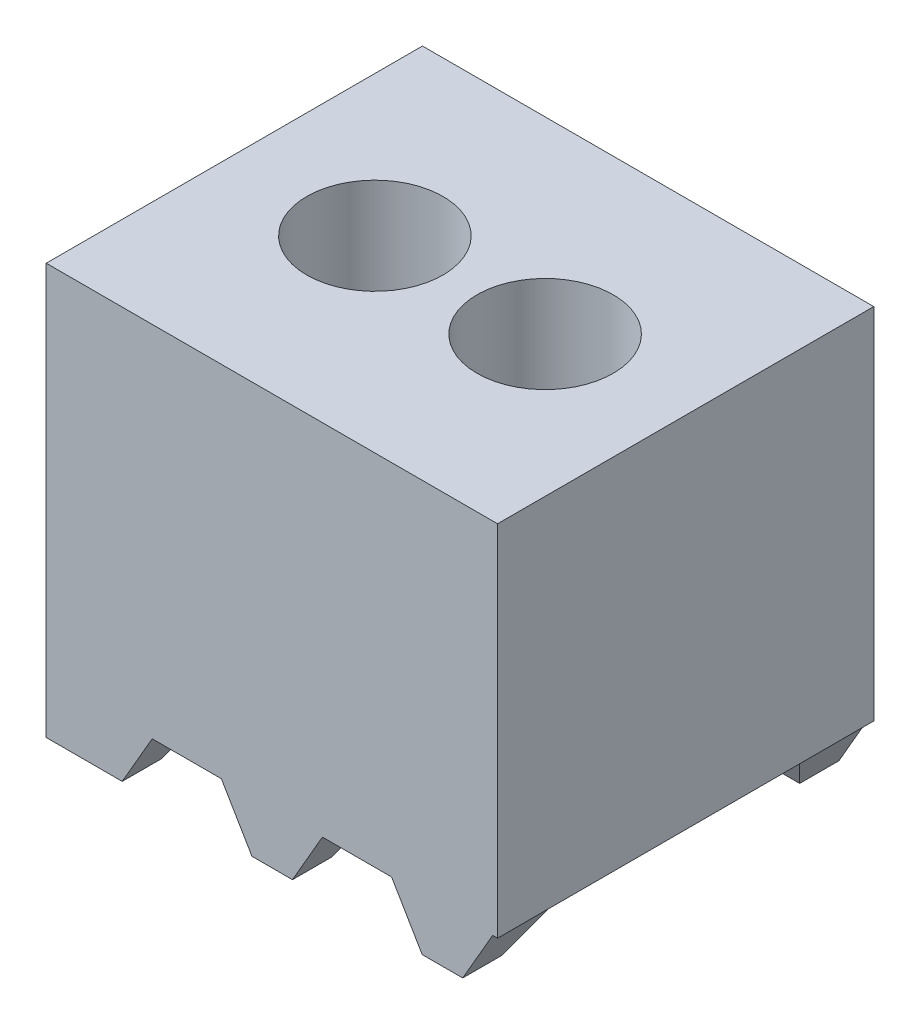
ISO-10303-21;
HEADER;
FILE_DESCRIPTION(('STEP AP214'),'2;1');
FILE_NAME('part.step','',(''),(''),'','','');
FILE_SCHEMA(('AUTOMOTIVE_DESIGN { 1 0 10303 214 1 1 1 1 }'));
ENDSEC;
DATA;
#1=APPLICATION_CONTEXT('core data for automotive mechanical design processes');
#2=APPLICATION_PROTOCOL_DEFINITION('international standard','automotive_design',2000,#1);
#3=PRODUCT_CONTEXT('',#1,'mechanical');
#4=PRODUCT('Part','Part','',(#3));
#5=PRODUCT_RELATED_PRODUCT_CATEGORY('part','',(#4));
#6=PRODUCT_DEFINITION_FORMATION('','',#4);
#7=PRODUCT_DEFINITION_CONTEXT('part definition',#1,'design');
#8=PRODUCT_DEFINITION('design','',#6,#7);
#9=PRODUCT_DEFINITION_SHAPE('','',#8);
#10=(LENGTH_UNIT() NAMED_UNIT(*) SI_UNIT(.MILLI.,.METRE.));
#11=(NAMED_UNIT(*) PLANE_ANGLE_UNIT() SI_UNIT($,.RADIAN.));
#12=(NAMED_UNIT(*) SI_UNIT($,.STERADIAN.) SOLID_ANGLE_UNIT());
#13=UNCERTAINTY_MEASURE_WITH_UNIT(LENGTH_MEASURE(1.E-05),#10,'distance_accuracy_value','');
#14=(GEOMETRIC_REPRESENTATION_CONTEXT(3) GLOBAL_UNCERTAINTY_ASSIGNED_CONTEXT((#13)) GLOBAL_UNIT_ASSIGNED_CONTEXT((#10,
#11,#12)) REPRESENTATION_CONTEXT('',''));
#15=CARTESIAN_POINT('',(0.,0.,0.));
#16=DIRECTION('',(0.,0.,1.));
#17=DIRECTION('',(1.,0.,0.));
#18=AXIS2_PLACEMENT_3D('',#15,#16,#17);
#19=CARTESIAN_POINT('',(0.,-2.413,0.));
#20=DIRECTION('',(0.,1.,0.));
#21=DIRECTION('',(0.,0.,1.));
#22=AXIS2_PLACEMENT_3D('',#19,#20,#21);
#23=PLANE('',#22);
#24=DIRECTION('',(1.,0.,0.));
#25=VECTOR('',#24,1.);
#26=CARTESIAN_POINT('',(0.,-2.413,-0.230423637951));
#27=LINE('',#26,#25);
#28=CARTESIAN_POINT('',(2.20832172,-2.413,-0.230423637951));
#29=VERTEX_POINT('',#28);
#30=CARTESIAN_POINT('',(2.44631972,-2.413,-0.230423637950998));
#31=VERTEX_POINT('',#30);
#32=EDGE_CURVE('E379',#29,#31,#27,.T.);
#33=ORIENTED_EDGE('',*,*,#32,.T.);
#34=DIRECTION('',(0.,0.,1.));
#35=VECTOR('',#34,1.);
#36=CARTESIAN_POINT('',(2.44631972,-2.413,-2.2098));
#37=LINE('',#36,#35);
#38=CARTESIAN_POINT('',(2.44631972,-2.413,0.));
#39=VERTEX_POINT('',#38);
#40=EDGE_CURVE('E198',#31,#39,#37,.T.);
#41=ORIENTED_EDGE('',*,*,#40,.T.);
#42=DIRECTION('',(1.,0.,0.));
#43=VECTOR('',#42,1.);
#44=CARTESIAN_POINT('',(0.,-2.413,0.));
#45=LINE('',#44,#43);
#46=CARTESIAN_POINT('',(2.20832172,-2.413,0.));
#47=VERTEX_POINT('',#46);
#48=EDGE_CURVE('E348',#47,#39,#45,.T.);
#49=ORIENTED_EDGE('',*,*,#48,.F.);
#50=DIRECTION('',(0.,0.,1.));
#51=VECTOR('',#50,1.);
#52=CARTESIAN_POINT('',(2.20832172,-2.413,-2.2098));
#53=LINE('',#52,#51);
#54=EDGE_CURVE('E245',#29,#47,#53,.T.);
#55=ORIENTED_EDGE('',*,*,#54,.F.);
#56=EDGE_LOOP('',(#33,#41,#49,#55));
#57=FACE_BOUND('',#56,.T.);
#58=ADVANCED_FACE('F16',(#57),#23,.F.);
#59=DIRECTION('',(-1.,0.,0.));
#60=VECTOR('',#59,1.);
#61=CARTESIAN_POINT('',(2.650998,-2.413,-2.2098));
#62=LINE('',#61,#60);
#63=CARTESIAN_POINT('',(2.44631972,-2.413,-2.2098));
#64=VERTEX_POINT('',#63);
#65=CARTESIAN_POINT('',(2.20832172,-2.413,-2.2098));
#66=VERTEX_POINT('',#65);
#67=EDGE_CURVE('E355',#64,#66,#62,.T.);
#68=ORIENTED_EDGE('',*,*,#67,.F.);
#69=CARTESIAN_POINT('',(2.44631972,-2.413,-1.979376362049));
#70=VERTEX_POINT('',#69);
#71=EDGE_CURVE('E204',#64,#70,#37,.T.);
#72=ORIENTED_EDGE('',*,*,#71,.T.);
#73=DIRECTION('',(-1.,0.,0.));
#74=VECTOR('',#73,1.);
#75=CARTESIAN_POINT('',(0.,-2.413,-1.979376362049));
#76=LINE('',#75,#74);
#77=CARTESIAN_POINT('',(2.20832172,-2.413,-1.979376362049));
#78=VERTEX_POINT('',#77);
#79=EDGE_CURVE('E377',#70,#78,#76,.T.);
#80=ORIENTED_EDGE('',*,*,#79,.T.);
#81=EDGE_CURVE('E242',#66,#78,#53,.T.);
#82=ORIENTED_EDGE('',*,*,#81,.F.);
#83=EDGE_LOOP('',(#68,#72,#80,#82));
#84=FACE_BOUND('',#83,.T.);
#85=ADVANCED_FACE('F408',(#84),#23,.F.);
#86=CARTESIAN_POINT('',(-61.230002,-2.1082,-0.406400000000001));
#87=DIRECTION('',(0.,0.500000000000006,0.866025403784435));
#88=DIRECTION('',(0.,-0.866025403784435,0.500000000000006));
#89=AXIS2_PLACEMENT_3D('',#86,#87,#88);
#90=PLANE('',#89);
#91=DIRECTION('',(1.,0.,0.));
#92=VECTOR('',#91,1.);
#93=CARTESIAN_POINT('',(-61.230002,-2.1082,-0.406400000000001));
#94=LINE('',#93,#92);
#95=CARTESIAN_POINT('',(2.028698082049,-2.1082,-0.406400000000001));
#96=VERTEX_POINT('',#95);
#97=CARTESIAN_POINT('',(2.622296082049,-2.1082,-0.406400000000001));
#98=VERTEX_POINT('',#97);
#99=EDGE_CURVE('E333',#96,#98,#94,.T.);
#100=ORIENTED_EDGE('',*,*,#99,.T.);
#101=DIRECTION('',(-0.447213595499953,-0.774596669241482,0.447213595499965));
#102=VECTOR('',#101,1.);
#103=CARTESIAN_POINT('',(-10.1481635343605,-24.2272848916281,12.3640596164098));
#104=LINE('',#103,#102);
#105=EDGE_CURVE('E218',#98,#31,#104,.T.);
#106=ORIENTED_EDGE('',*,*,#105,.T.);
#107=ORIENTED_EDGE('',*,*,#32,.F.);
#108=DIRECTION('',(-0.454582630893607,0.771372785213077,-0.445352285188329));
#109=VECTOR('',#108,1.);
#110=CARTESIAN_POINT('',(-11.0434192952275,20.0736320909451,-13.2130867288264));
#111=LINE('',#110,#109);
#112=EDGE_CURVE('E260',#29,#96,#111,.T.);
#113=ORIENTED_EDGE('',*,*,#112,.T.);
#114=EDGE_LOOP('',(#100,#106,#107,#113));
#115=FACE_BOUND('',#114,.T.);
#116=ADVANCED_FACE('F415',(#115),#90,.F.);
#117=CARTESIAN_POINT('',(-61.230002,-2.1082,-1.80339999999999));
#118=DIRECTION('',(0.,0.500000000000009,-0.866025403784434));
#119=DIRECTION('',(0.,0.866025403784434,0.500000000000009));
#120=AXIS2_PLACEMENT_3D('',#117,#118,#119);
#121=PLANE('',#120);
#122=ORIENTED_EDGE('',*,*,#79,.F.);
#123=DIRECTION('',(0.447213595499952,0.774596669241481,0.447213595499967));
#124=VECTOR('',#123,1.);
#125=CARTESIAN_POINT('',(-10.1481635343605,-24.227284891628,-14.5738596164099));
#126=LINE('',#125,#124);
#127=CARTESIAN_POINT('',(2.622296082049,-2.1082,-1.80339999999999));
#128=VERTEX_POINT('',#127);
#129=EDGE_CURVE('E215',#70,#128,#126,.T.);
#130=ORIENTED_EDGE('',*,*,#129,.T.);
#131=DIRECTION('',(1.,0.,0.));
#132=VECTOR('',#131,1.);
#133=CARTESIAN_POINT('',(-61.230002,-2.1082,-1.80339999999999));
#134=LINE('',#133,#132);
#135=CARTESIAN_POINT('',(2.028698082049,-2.1082,-1.80339999999999));
#136=VERTEX_POINT('',#135);
#137=EDGE_CURVE('E195',#136,#128,#134,.T.);
#138=ORIENTED_EDGE('',*,*,#137,.F.);
#139=DIRECTION('',(0.454582630893606,-0.771372785213076,-0.445352285188331));
#140=VECTOR('',#139,1.);
#141=CARTESIAN_POINT('',(-11.0434192952275,20.073632090945,11.0032867288265));
#142=LINE('',#141,#140);
#143=EDGE_CURVE('E257',#136,#78,#142,.T.);
#144=ORIENTED_EDGE('',*,*,#143,.T.);
#145=EDGE_LOOP('',(#122,#130,#138,#144));
#146=FACE_BOUND('',#145,.T.);
#147=ADVANCED_FACE('F448',(#146),#121,.F.);
#148=CARTESIAN_POINT('',(1.20832372,-2.413,-0.230423637951));
#149=VERTEX_POINT('',#148);
#150=CARTESIAN_POINT('',(1.44632172,-2.413,-0.230423637950998));
#151=VERTEX_POINT('',#150);
#152=EDGE_CURVE('E383',#149,#151,#27,.T.);
#153=ORIENTED_EDGE('',*,*,#152,.T.);
#154=DIRECTION('',(0.,0.,1.));
#155=VECTOR('',#154,1.);
#156=CARTESIAN_POINT('',(1.44632172,-2.413,-2.2098));
#157=LINE('',#156,#155);
#158=CARTESIAN_POINT('',(1.44632172,-2.413,0.));
#159=VERTEX_POINT('',#158);
#160=EDGE_CURVE('E249',#151,#159,#157,.T.);
#161=ORIENTED_EDGE('',*,*,#160,.T.);
#162=CARTESIAN_POINT('',(1.20832372,-2.413,0.));
#163=VERTEX_POINT('',#162);
#164=EDGE_CURVE('E354',#163,#159,#45,.T.);
#165=ORIENTED_EDGE('',*,*,#164,.F.);
#166=DIRECTION('',(0.,0.,1.));
#167=VECTOR('',#166,1.);
#168=CARTESIAN_POINT('',(1.20832372,-2.413,-2.2098));
#169=LINE('',#168,#167);
#170=EDGE_CURVE('E289',#149,#163,#169,.T.);
#171=ORIENTED_EDGE('',*,*,#170,.F.);
#172=EDGE_LOOP('',(#153,#161,#165,#171));
#173=FACE_BOUND('',#172,.T.);
#174=ADVANCED_FACE('F417',(#173),#23,.F.);
#175=CARTESIAN_POINT('',(1.44632172,-2.413,-2.2098));
#176=VERTEX_POINT('',#175);
#177=CARTESIAN_POINT('',(1.20832372,-2.413,-2.2098));
#178=VERTEX_POINT('',#177);
#179=EDGE_CURVE('E358',#176,#178,#62,.T.);
#180=ORIENTED_EDGE('',*,*,#179,.F.);
#181=CARTESIAN_POINT('',(1.44632172,-2.413,-1.979376362049));
#182=VERTEX_POINT('',#181);
#183=EDGE_CURVE('E246',#176,#182,#157,.T.);
#184=ORIENTED_EDGE('',*,*,#183,.T.);
#185=CARTESIAN_POINT('',(1.20832372,-2.413,-1.979376362049));
#186=VERTEX_POINT('',#185);
#187=EDGE_CURVE('E380',#182,#186,#76,.T.);
#188=ORIENTED_EDGE('',*,*,#187,.T.);
#189=EDGE_CURVE('E286',#178,#186,#169,.T.);
#190=ORIENTED_EDGE('',*,*,#189,.F.);
#191=EDGE_LOOP('',(#180,#184,#188,#190));
#192=FACE_BOUND('',#191,.T.);
#193=ADVANCED_FACE('F438',(#192),#23,.F.);
#194=CARTESIAN_POINT('',(1.028700082049,-2.1082,-0.406400000000001));
#195=VERTEX_POINT('',#194);
#196=CARTESIAN_POINT('',(1.622298082049,-2.1082,-0.406400000000001));
#197=VERTEX_POINT('',#196);
#198=EDGE_CURVE('E332',#195,#197,#94,.T.);
#199=ORIENTED_EDGE('',*,*,#198,.T.);
#200=DIRECTION('',(-0.447213595499953,-0.774596669241482,0.447213595499965));
#201=VECTOR('',#200,1.);
#202=CARTESIAN_POINT('',(-10.9481619343605,-23.8808754229346,12.1640600164098));
#203=LINE('',#202,#201);
#204=EDGE_CURVE('E254',#197,#151,#203,.T.);
#205=ORIENTED_EDGE('',*,*,#204,.T.);
#206=ORIENTED_EDGE('',*,*,#152,.F.);
#207=DIRECTION('',(-0.454582630893607,0.771372785213077,-0.445352285188329));
#208=VECTOR('',#207,1.);
#209=CARTESIAN_POINT('',(-11.8367723402081,19.7229801221486,-13.0106377202499));
#210=LINE('',#209,#208);
#211=EDGE_CURVE('E304',#149,#195,#210,.T.);
#212=ORIENTED_EDGE('',*,*,#211,.T.);
#213=EDGE_LOOP('',(#199,#205,#206,#212));
#214=FACE_BOUND('',#213,.T.);
#215=ADVANCED_FACE('F444',(#214),#90,.F.);
#216=ORIENTED_EDGE('',*,*,#187,.F.);
#217=DIRECTION('',(0.447213595499952,0.774596669241481,0.447213595499967));
#218=VECTOR('',#217,1.);
#219=CARTESIAN_POINT('',(-10.9481619343605,-23.8808754229345,-14.3738600164099));
#220=LINE('',#219,#218);
#221=CARTESIAN_POINT('',(1.622298082049,-2.1082,-1.80339999999999));
#222=VERTEX_POINT('',#221);
#223=EDGE_CURVE('E240',#182,#222,#220,.T.);
#224=ORIENTED_EDGE('',*,*,#223,.T.);
#225=CARTESIAN_POINT('',(1.028700082049,-2.1082,-1.8034));
#226=VERTEX_POINT('',#225);
#227=EDGE_CURVE('E337',#226,#222,#134,.T.);
#228=ORIENTED_EDGE('',*,*,#227,.F.);
#229=DIRECTION('',(0.454582630893606,-0.771372785213076,-0.445352285188331));
#230=VECTOR('',#229,1.);
#231=CARTESIAN_POINT('',(-11.8367723402081,19.7229801221485,10.8008377202499));
#232=LINE('',#231,#230);
#233=EDGE_CURVE('E301',#226,#186,#232,.T.);
#234=ORIENTED_EDGE('',*,*,#233,.T.);
#235=EDGE_LOOP('',(#216,#224,#228,#234));
#236=FACE_BOUND('',#235,.T.);
#237=ADVANCED_FACE('F436',(#236),#121,.F.);
#238=CARTESIAN_POINT('',(0.,-2.413,-0.230423637951));
#239=VERTEX_POINT('',#238);
#240=CARTESIAN_POINT('',(0.446323719999994,-2.413,-0.230423637951001));
#241=VERTEX_POINT('',#240);
#242=EDGE_CURVE('E24',#239,#241,#27,.T.);
#243=ORIENTED_EDGE('',*,*,#242,.T.);
#244=DIRECTION('',(0.,0.,1.));
#245=VECTOR('',#244,1.);
#246=CARTESIAN_POINT('',(0.44632372,-2.413,-2.2098));
#247=LINE('',#246,#245);
#248=CARTESIAN_POINT('',(0.44632372,-2.413,0.));
#249=VERTEX_POINT('',#248);
#250=EDGE_CURVE('E293',#241,#249,#247,.T.);
#251=ORIENTED_EDGE('',*,*,#250,.T.);
#252=CARTESIAN_POINT('',(0.,-2.413,0.));
#253=VERTEX_POINT('',#252);
#254=EDGE_CURVE('E350',#253,#249,#45,.T.);
#255=ORIENTED_EDGE('',*,*,#254,.F.);
#256=DIRECTION('',(0.,0.,1.));
#257=VECTOR('',#256,1.);
#258=CARTESIAN_POINT('',(0.,-2.413,-2.2098));
#259=LINE('',#258,#257);
#260=EDGE_CURVE('E349',#239,#253,#259,.T.);
#261=ORIENTED_EDGE('',*,*,#260,.F.);
#262=EDGE_LOOP('',(#243,#251,#255,#261));
#263=FACE_BOUND('',#262,.T.);
#264=ADVANCED_FACE('F425',(#263),#23,.F.);
#265=CARTESIAN_POINT('',(0.,-2.413,-2.2098));
#266=DIRECTION('',(-1.,0.,0.));
#267=DIRECTION('',(0.,0.,1.));
#268=AXIS2_PLACEMENT_3D('',#265,#266,#267);
#269=PLANE('',#268);
#270=DIRECTION('',(0.,0.866025403784435,-0.500000000000006));
#271=VECTOR('',#270,1.);
#272=CARTESIAN_POINT('',(0.,-1.55590489340756,-0.725267728463262));
#273=LINE('',#272,#271);
#274=CARTESIAN_POINT('',(0.,-2.1082,-0.406400000000001));
#275=VERTEX_POINT('',#274);
#276=EDGE_CURVE('E340',#239,#275,#273,.T.);
#277=ORIENTED_EDGE('',*,*,#276,.F.);
#278=ORIENTED_EDGE('',*,*,#260,.T.);
#279=DIRECTION('',(0.,1.,0.));
#280=VECTOR('',#279,1.);
#281=CARTESIAN_POINT('',(0.,-2.413,0.));
#282=LINE('',#281,#280);
#283=CARTESIAN_POINT('',(0.,0.,0.));
#284=VERTEX_POINT('',#283);
#285=EDGE_CURVE('E357',#253,#284,#282,.T.);
#286=ORIENTED_EDGE('',*,*,#285,.T.);
#287=DIRECTION('',(0.,0.,1.));
#288=VECTOR('',#287,1.);
#289=CARTESIAN_POINT('',(0.,0.,-2.2098));
#290=LINE('',#289,#288);
#291=CARTESIAN_POINT('',(0.,0.,-2.2098));
#292=VERTEX_POINT('',#291);
#293=EDGE_CURVE('E344',#292,#284,#290,.T.);
#294=ORIENTED_EDGE('',*,*,#293,.F.);
#295=DIRECTION('',(0.,1.,0.));
#296=VECTOR('',#295,1.);
#297=CARTESIAN_POINT('',(0.,-2.413,-2.2098));
#298=LINE('',#297,#296);
#299=CARTESIAN_POINT('',(0.,-2.413,-2.2098));
#300=VERTEX_POINT('',#299);
#301=EDGE_CURVE('E370',#300,#292,#298,.T.);
#302=ORIENTED_EDGE('',*,*,#301,.F.);
#303=CARTESIAN_POINT('',(0.,-2.413,-1.979376362049));
#304=VERTEX_POINT('',#303);
#305=EDGE_CURVE('E345',#300,#304,#259,.T.);
#306=ORIENTED_EDGE('',*,*,#305,.T.);
#307=DIRECTION('',(0.,-0.866025403784434,-0.500000000000009));
#308=VECTOR('',#307,1.);
#309=CARTESIAN_POINT('',(0.,-2.512776362049,-2.03698227153675));
#310=LINE('',#309,#308);
#311=CARTESIAN_POINT('',(0.,-2.1082,-1.80339999999999));
#312=VERTEX_POINT('',#311);
#313=EDGE_CURVE('E331',#312,#304,#310,.T.);
#314=ORIENTED_EDGE('',*,*,#313,.F.);
#315=DIRECTION('',(0.,0.,-1.));
#316=VECTOR('',#315,1.);
#317=CARTESIAN_POINT('',(0.,-2.1082,-2.2098));
#318=LINE('',#317,#316);
#319=EDGE_CURVE('E342',#275,#312,#318,.T.);
#320=ORIENTED_EDGE('',*,*,#319,.F.);
#321=EDGE_LOOP('',(#277,#278,#286,#294,#302,#306,#314,#320));
#322=FACE_BOUND('',#321,.T.);
#323=ADVANCED_FACE('F18',(#322),#269,.T.);
#324=CARTESIAN_POINT('',(2.650998,-2.413,-2.2098));
#325=DIRECTION('',(0.,0.,-1.));
#326=DIRECTION('',(-1.,0.,0.));
#327=AXIS2_PLACEMENT_3D('',#324,#325,#326);
#328=PLANE('',#327);
#329=DIRECTION('',(-1.,0.,0.));
#330=VECTOR('',#329,1.);
#331=CARTESIAN_POINT('',(2.622296082049,-2.1082,-2.2098));
#332=LINE('',#331,#330);
#333=CARTESIAN_POINT('',(2.650998,-2.1082,-2.2098));
#334=VERTEX_POINT('',#333);
#335=CARTESIAN_POINT('',(2.622296082049,-2.1082,-2.2098));
#336=VERTEX_POINT('',#335);
#337=EDGE_CURVE('E191',#334,#336,#332,.T.);
#338=ORIENTED_EDGE('',*,*,#337,.T.);
#339=DIRECTION('',(-0.499999999999996,-0.866025403784441,0.));
#340=VECTOR('',#339,1.);
#341=CARTESIAN_POINT('',(2.44631972,-2.413,-2.2098));
#342=LINE('',#341,#340);
#343=EDGE_CURVE('E201',#336,#64,#342,.T.);
#344=ORIENTED_EDGE('',*,*,#343,.T.);
#345=ORIENTED_EDGE('',*,*,#67,.T.);
#346=DIRECTION('',(-0.507711928450994,0.861526899004653,0.));
#347=VECTOR('',#346,1.);
#348=CARTESIAN_POINT('',(2.20832172,-2.413,-2.2098));
#349=LINE('',#348,#347);
#350=CARTESIAN_POINT('',(2.028698082049,-2.1082,-2.2098));
#351=VERTEX_POINT('',#350);
#352=EDGE_CURVE('E229',#66,#351,#349,.T.);
#353=ORIENTED_EDGE('',*,*,#352,.T.);
#354=DIRECTION('',(-1.,0.,0.));
#355=VECTOR('',#354,1.);
#356=CARTESIAN_POINT('',(1.622298082049,-2.1082,-2.2098));
#357=LINE('',#356,#355);
#358=CARTESIAN_POINT('',(1.622298082049,-2.1082,-2.2098));
#359=VERTEX_POINT('',#358);
#360=EDGE_CURVE('E222',#351,#359,#357,.T.);
#361=ORIENTED_EDGE('',*,*,#360,.T.);
#362=DIRECTION('',(-0.499999999999996,-0.866025403784441,0.));
#363=VECTOR('',#362,1.);
#364=CARTESIAN_POINT('',(1.44632172,-2.413,-2.2098));
#365=LINE('',#364,#363);
#366=EDGE_CURVE('E225',#359,#176,#365,.T.);
#367=ORIENTED_EDGE('',*,*,#366,.T.);
#368=ORIENTED_EDGE('',*,*,#179,.T.);
#369=DIRECTION('',(-0.507711928450994,0.861526899004653,0.));
#370=VECTOR('',#369,1.);
#371=CARTESIAN_POINT('',(1.20832372,-2.413,-2.2098));
#372=LINE('',#371,#370);
#373=CARTESIAN_POINT('',(1.028700082049,-2.1082,-2.2098));
#374=VERTEX_POINT('',#373);
#375=EDGE_CURVE('E271',#178,#374,#372,.T.);
#376=ORIENTED_EDGE('',*,*,#375,.T.);
#377=DIRECTION('',(-1.,0.,0.));
#378=VECTOR('',#377,1.);
#379=CARTESIAN_POINT('',(0.622300082048996,-2.1082,-2.2098));
#380=LINE('',#379,#378);
#381=CARTESIAN_POINT('',(0.622300082048996,-2.1082,-2.2098));
#382=VERTEX_POINT('',#381);
#383=EDGE_CURVE('E264',#374,#382,#380,.T.);
#384=ORIENTED_EDGE('',*,*,#383,.T.);
#385=DIRECTION('',(-0.499999999999996,-0.866025403784441,0.));
#386=VECTOR('',#385,1.);
#387=CARTESIAN_POINT('',(0.44632372,-2.413,-2.2098));
#388=LINE('',#387,#386);
#389=CARTESIAN_POINT('',(0.44632372,-2.413,-2.2098));
#390=VERTEX_POINT('',#389);
#391=EDGE_CURVE('E267',#382,#390,#388,.T.);
#392=ORIENTED_EDGE('',*,*,#391,.T.);
#393=EDGE_CURVE('E353',#390,#300,#62,.T.);
#394=ORIENTED_EDGE('',*,*,#393,.T.);
#395=ORIENTED_EDGE('',*,*,#301,.T.);
#396=DIRECTION('',(-1.,0.,0.));
#397=VECTOR('',#396,1.);
#398=CARTESIAN_POINT('',(2.650998,0.,-2.2098));
#399=LINE('',#398,#397);
#400=CARTESIAN_POINT('',(2.650998,0.,-2.2098));
#401=VERTEX_POINT('',#400);
#402=EDGE_CURVE('E367',#401,#292,#399,.T.);
#403=ORIENTED_EDGE('',*,*,#402,.F.);
#404=DIRECTION('',(0.,1.,0.));
#405=VECTOR('',#404,1.);
#406=CARTESIAN_POINT('',(2.650998,-2.413,-2.2098));
#407=LINE('',#406,#405);
#408=EDGE_CURVE('E210',#334,#401,#407,.T.);
#409=ORIENTED_EDGE('',*,*,#408,.F.);
#410=EDGE_LOOP('',(#338,#344,#345,#353,#361,#367,#368,#376,#384,#392,#394,#395,#403,#409));
#411=FACE_BOUND('',#410,.T.);
#412=ADVANCED_FACE('F208',(#411),#328,.T.);
#413=CARTESIAN_POINT('',(2.650998,-2.413,0.));
#414=DIRECTION('',(1.,0.,0.));
#415=DIRECTION('',(0.,0.,-1.));
#416=AXIS2_PLACEMENT_3D('',#413,#414,#415);
#417=PLANE('',#416);
#418=DIRECTION('',(0.,0.,1.));
#419=VECTOR('',#418,1.);
#420=CARTESIAN_POINT('',(2.650998,-2.1082,-0.406400000000001));
#421=LINE('',#420,#419);
#422=CARTESIAN_POINT('',(2.650998,-2.1082,0.));
#423=VERTEX_POINT('',#422);
#424=EDGE_CURVE('E31',#334,#423,#421,.T.);
#425=ORIENTED_EDGE('',*,*,#424,.F.);
#426=ORIENTED_EDGE('',*,*,#408,.T.);
#427=DIRECTION('',(0.,0.,-1.));
#428=VECTOR('',#427,1.);
#429=CARTESIAN_POINT('',(2.650998,0.,0.));
#430=LINE('',#429,#428);
#431=CARTESIAN_POINT('',(2.650998,0.,0.));
#432=VERTEX_POINT('',#431);
#433=EDGE_CURVE('E364',#432,#401,#430,.T.);
#434=ORIENTED_EDGE('',*,*,#433,.F.);
#435=DIRECTION('',(0.,1.,0.));
#436=VECTOR('',#435,1.);
#437=CARTESIAN_POINT('',(2.650998,-2.413,0.));
#438=LINE('',#437,#436);
#439=EDGE_CURVE('E374',#423,#432,#438,.T.);
#440=ORIENTED_EDGE('',*,*,#439,.F.);
#441=EDGE_LOOP('',(#425,#426,#434,#440));
#442=FACE_BOUND('',#441,.T.);
#443=ADVANCED_FACE('F432',(#442),#417,.T.);
#444=CARTESIAN_POINT('',(0.,-2.413,0.));
#445=DIRECTION('',(0.,0.,1.));
#446=DIRECTION('',(1.,0.,0.));
#447=AXIS2_PLACEMENT_3D('',#444,#445,#446);
#448=PLANE('',#447);
#449=DIRECTION('',(-1.,0.,0.));
#450=VECTOR('',#449,1.);
#451=CARTESIAN_POINT('',(0.,-2.1082,0.));
#452=LINE('',#451,#450);
#453=CARTESIAN_POINT('',(2.622296082049,-2.1082,0.));
#454=VERTEX_POINT('',#453);
#455=EDGE_CURVE('E11',#423,#454,#452,.T.);
#456=ORIENTED_EDGE('',*,*,#455,.F.);
#457=ORIENTED_EDGE('',*,*,#439,.T.);
#458=DIRECTION('',(1.,0.,0.));
#459=VECTOR('',#458,1.);
#460=CARTESIAN_POINT('',(0.,0.,0.));
#461=LINE('',#460,#459);
#462=EDGE_CURVE('E361',#284,#432,#461,.T.);
#463=ORIENTED_EDGE('',*,*,#462,.F.);
#464=ORIENTED_EDGE('',*,*,#285,.F.);
#465=ORIENTED_EDGE('',*,*,#254,.T.);
#466=DIRECTION('',(-0.499999999999996,-0.866025403784441,0.));
#467=VECTOR('',#466,1.);
#468=CARTESIAN_POINT('',(0.44632372,-2.413,0.));
#469=LINE('',#468,#467);
#470=CARTESIAN_POINT('',(0.622300082048996,-2.1082,0.));
#471=VERTEX_POINT('',#470);
#472=EDGE_CURVE('E277',#471,#249,#469,.T.);
#473=ORIENTED_EDGE('',*,*,#472,.F.);
#474=DIRECTION('',(-1.,0.,0.));
#475=VECTOR('',#474,1.);
#476=CARTESIAN_POINT('',(0.622300082048996,-2.1082,0.));
#477=LINE('',#476,#475);
#478=CARTESIAN_POINT('',(1.028700082049,-2.1082,0.));
#479=VERTEX_POINT('',#478);
#480=EDGE_CURVE('E263',#479,#471,#477,.T.);
#481=ORIENTED_EDGE('',*,*,#480,.F.);
#482=DIRECTION('',(-0.507711928450994,0.861526899004653,0.));
#483=VECTOR('',#482,1.);
#484=CARTESIAN_POINT('',(1.20832372,-2.413,0.));
#485=LINE('',#484,#483);
#486=EDGE_CURVE('E268',#163,#479,#485,.T.);
#487=ORIENTED_EDGE('',*,*,#486,.F.);
#488=ORIENTED_EDGE('',*,*,#164,.T.);
#489=DIRECTION('',(-0.499999999999996,-0.866025403784441,0.));
#490=VECTOR('',#489,1.);
#491=CARTESIAN_POINT('',(1.44632172,-2.413,0.));
#492=LINE('',#491,#490);
#493=CARTESIAN_POINT('',(1.622298082049,-2.1082,0.));
#494=VERTEX_POINT('',#493);
#495=EDGE_CURVE('E234',#494,#159,#492,.T.);
#496=ORIENTED_EDGE('',*,*,#495,.F.);
#497=DIRECTION('',(-1.,0.,0.));
#498=VECTOR('',#497,1.);
#499=CARTESIAN_POINT('',(1.622298082049,-2.1082,0.));
#500=LINE('',#499,#498);
#501=CARTESIAN_POINT('',(2.028698082049,-2.1082,0.));
#502=VERTEX_POINT('',#501);
#503=EDGE_CURVE('E221',#502,#494,#500,.T.);
#504=ORIENTED_EDGE('',*,*,#503,.F.);
#505=DIRECTION('',(-0.507711928450994,0.861526899004653,0.));
#506=VECTOR('',#505,1.);
#507=CARTESIAN_POINT('',(2.20832172,-2.413,0.));
#508=LINE('',#507,#506);
#509=EDGE_CURVE('E226',#47,#502,#508,.T.);
#510=ORIENTED_EDGE('',*,*,#509,.F.);
#511=ORIENTED_EDGE('',*,*,#48,.T.);
#512=DIRECTION('',(-0.499999999999996,-0.866025403784441,0.));
#513=VECTOR('',#512,1.);
#514=CARTESIAN_POINT('',(2.44631972,-2.413,0.));
#515=LINE('',#514,#513);
#516=EDGE_CURVE('E211',#454,#39,#515,.T.);
#517=ORIENTED_EDGE('',*,*,#516,.F.);
#518=EDGE_LOOP('',(#456,#457,#463,#464,#465,#473,#481,#487,#488,#496,#504,#510,#511,#517));
#519=FACE_BOUND('',#518,.T.);
#520=ADVANCED_FACE('F423',(#519),#448,.T.);
#521=ORIENTED_EDGE('',*,*,#393,.F.);
#522=CARTESIAN_POINT('',(0.446323719999999,-2.413,-1.979376362049));
#523=VERTEX_POINT('',#522);
#524=EDGE_CURVE('E290',#390,#523,#247,.T.);
#525=ORIENTED_EDGE('',*,*,#524,.T.);
#526=EDGE_CURVE('E372',#523,#304,#76,.T.);
#527=ORIENTED_EDGE('',*,*,#526,.T.);
#528=ORIENTED_EDGE('',*,*,#305,.F.);
#529=EDGE_LOOP('',(#521,#525,#527,#528));
#530=FACE_BOUND('',#529,.T.);
#531=ADVANCED_FACE('F411',(#530),#23,.F.);
#532=CARTESIAN_POINT('',(0.,0.,0.));
#533=DIRECTION('',(0.,1.,0.));
#534=DIRECTION('',(0.,0.,1.));
#535=AXIS2_PLACEMENT_3D('',#532,#533,#534);
#536=PLANE('',#535);
#537=CARTESIAN_POINT('',(1.825498,0.,-1.1049));
#538=DIRECTION('',(0.,1.,0.));
#539=DIRECTION('',(0.,0.,1.));
#540=AXIS2_PLACEMENT_3D('',#537,#538,#539);
#541=CIRCLE('',#540,0.400049999999999);
#542=CARTESIAN_POINT('',(1.825498,0.,-0.704850000000001));
#543=VERTEX_POINT('',#542);
#544=EDGE_CURVE('E307',#543,#543,#541,.T.);
#545=ORIENTED_EDGE('',*,*,#544,.F.);
#546=EDGE_LOOP('',(#545));
#547=FACE_BOUND('',#546,.T.);
#548=CARTESIAN_POINT('',(0.825499999999998,0.,-1.1049));
#549=DIRECTION('',(0.,1.,0.));
#550=DIRECTION('',(0.,0.,1.));
#551=AXIS2_PLACEMENT_3D('',#548,#549,#550);
#552=CIRCLE('',#551,0.400049999999999);
#553=CARTESIAN_POINT('',(0.825499999999998,0.,-0.704850000000001));
#554=VERTEX_POINT('',#553);
#555=EDGE_CURVE('E317',#554,#554,#552,.T.);
#556=ORIENTED_EDGE('',*,*,#555,.F.);
#557=EDGE_LOOP('',(#556));
#558=FACE_BOUND('',#557,.T.);
#559=ORIENTED_EDGE('',*,*,#293,.T.);
#560=ORIENTED_EDGE('',*,*,#462,.T.);
#561=ORIENTED_EDGE('',*,*,#433,.T.);
#562=ORIENTED_EDGE('',*,*,#402,.T.);
#563=EDGE_LOOP('',(#559,#560,#561,#562));
#564=FACE_BOUND('',#563,.T.);
#565=ADVANCED_FACE('F422',(#547,#558,#564),#536,.T.);
#566=CARTESIAN_POINT('',(0.622300082048996,-2.1082,-0.406400000000001));
#567=VERTEX_POINT('',#566);
#568=EDGE_CURVE('E328',#275,#567,#94,.T.);
#569=ORIENTED_EDGE('',*,*,#568,.T.);
#570=DIRECTION('',(-0.447213595499953,-0.774596669241482,0.447213595499965));
#571=VECTOR('',#570,1.);
#572=CARTESIAN_POINT('',(-11.7481603343605,-23.5344659542412,11.9640604164098));
#573=LINE('',#572,#571);
#574=EDGE_CURVE('E298',#567,#241,#573,.T.);
#575=ORIENTED_EDGE('',*,*,#574,.T.);
#576=ORIENTED_EDGE('',*,*,#242,.F.);
#577=ORIENTED_EDGE('',*,*,#276,.T.);
#578=EDGE_LOOP('',(#569,#575,#576,#577));
#579=FACE_BOUND('',#578,.T.);
#580=ADVANCED_FACE('F430',(#579),#90,.F.);
#581=CARTESIAN_POINT('',(-61.230002,-2.1082,-0.406400000000001));
#582=DIRECTION('',(0.,1.,0.));
#583=DIRECTION('',(0.,0.,1.));
#584=AXIS2_PLACEMENT_3D('',#581,#582,#583);
#585=PLANE('',#584);
#586=CARTESIAN_POINT('',(1.825498,-2.1082,-1.1049));
#587=DIRECTION('',(0.,1.,0.));
#588=DIRECTION('',(0.,0.,1.));
#589=AXIS2_PLACEMENT_3D('',#586,#587,#588);
#590=CIRCLE('',#589,0.32512);
#591=CARTESIAN_POINT('',(1.825498,-2.1082,-0.77978));
#592=VERTEX_POINT('',#591);
#593=EDGE_CURVE('E316',#592,#592,#590,.T.);
#594=ORIENTED_EDGE('',*,*,#593,.T.);
#595=EDGE_LOOP('',(#594));
#596=FACE_BOUND('',#595,.T.);
#597=CARTESIAN_POINT('',(0.825499999999998,-2.1082,-1.1049));
#598=DIRECTION('',(0.,1.,0.));
#599=DIRECTION('',(0.,0.,1.));
#600=AXIS2_PLACEMENT_3D('',#597,#598,#599);
#601=CIRCLE('',#600,0.32512);
#602=CARTESIAN_POINT('',(0.825499999999998,-2.1082,-0.77978));
#603=VERTEX_POINT('',#602);
#604=EDGE_CURVE('E326',#603,#603,#601,.T.);
#605=ORIENTED_EDGE('',*,*,#604,.T.);
#606=EDGE_LOOP('',(#605));
#607=FACE_BOUND('',#606,.T.);
#608=ORIENTED_EDGE('',*,*,#137,.T.);
#609=DIRECTION('',(0.,0.,1.));
#610=VECTOR('',#609,1.);
#611=CARTESIAN_POINT('',(2.622296082049,-2.1082,-2.2098));
#612=LINE('',#611,#610);
#613=EDGE_CURVE('E187',#336,#128,#612,.T.);
#614=ORIENTED_EDGE('',*,*,#613,.F.);
#615=ORIENTED_EDGE('',*,*,#337,.F.);
#616=ORIENTED_EDGE('',*,*,#424,.T.);
#617=ORIENTED_EDGE('',*,*,#455,.T.);
#618=EDGE_CURVE('E39',#98,#454,#612,.T.);
#619=ORIENTED_EDGE('',*,*,#618,.F.);
#620=ORIENTED_EDGE('',*,*,#99,.F.);
#621=DIRECTION('',(0.,0.,1.));
#622=VECTOR('',#621,1.);
#623=CARTESIAN_POINT('',(2.028698082049,-2.1082,-2.2098));
#624=LINE('',#623,#622);
#625=EDGE_CURVE('E241',#96,#502,#624,.T.);
#626=ORIENTED_EDGE('',*,*,#625,.T.);
#627=ORIENTED_EDGE('',*,*,#503,.T.);
#628=DIRECTION('',(0.,0.,1.));
#629=VECTOR('',#628,1.);
#630=CARTESIAN_POINT('',(1.622298082049,-2.1082,-2.2098));
#631=LINE('',#630,#629);
#632=EDGE_CURVE('E232',#197,#494,#631,.T.);
#633=ORIENTED_EDGE('',*,*,#632,.F.);
#634=ORIENTED_EDGE('',*,*,#198,.F.);
#635=DIRECTION('',(0.,0.,1.));
#636=VECTOR('',#635,1.);
#637=CARTESIAN_POINT('',(1.028700082049,-2.1082,-2.2098));
#638=LINE('',#637,#636);
#639=EDGE_CURVE('E285',#195,#479,#638,.T.);
#640=ORIENTED_EDGE('',*,*,#639,.T.);
#641=ORIENTED_EDGE('',*,*,#480,.T.);
#642=DIRECTION('',(0.,0.,1.));
#643=VECTOR('',#642,1.);
#644=CARTESIAN_POINT('',(0.622300082048996,-2.1082,-2.2098));
#645=LINE('',#644,#643);
#646=EDGE_CURVE('E274',#567,#471,#645,.T.);
#647=ORIENTED_EDGE('',*,*,#646,.F.);
#648=ORIENTED_EDGE('',*,*,#568,.F.);
#649=ORIENTED_EDGE('',*,*,#319,.T.);
#650=CARTESIAN_POINT('',(0.622300082048998,-2.1082,-1.80339999999999));
#651=VERTEX_POINT('',#650);
#652=EDGE_CURVE('E334',#312,#651,#134,.T.);
#653=ORIENTED_EDGE('',*,*,#652,.T.);
#654=EDGE_CURVE('E294',#382,#651,#645,.T.);
#655=ORIENTED_EDGE('',*,*,#654,.F.);
#656=ORIENTED_EDGE('',*,*,#383,.F.);
#657=EDGE_CURVE('E281',#374,#226,#638,.T.);
#658=ORIENTED_EDGE('',*,*,#657,.T.);
#659=ORIENTED_EDGE('',*,*,#227,.T.);
#660=EDGE_CURVE('E250',#359,#222,#631,.T.);
#661=ORIENTED_EDGE('',*,*,#660,.F.);
#662=ORIENTED_EDGE('',*,*,#360,.F.);
#663=EDGE_CURVE('E238',#351,#136,#624,.T.);
#664=ORIENTED_EDGE('',*,*,#663,.T.);
#665=EDGE_LOOP('',(#608,#614,#615,#616,#617,#619,#620,#626,#627,#633,#634,#640,#641,#647,#648,
#649,#653,#655,#656,#658,#659,#661,#662,#664));
#666=FACE_BOUND('',#665,.T.);
#667=ADVANCED_FACE('F189',(#596,#607,#666),#585,.F.);
#668=ORIENTED_EDGE('',*,*,#526,.F.);
#669=DIRECTION('',(0.447213595499952,0.774596669241481,0.447213595499967));
#670=VECTOR('',#669,1.);
#671=CARTESIAN_POINT('',(-11.7481603343605,-23.5344659542411,-14.1738604164099));
#672=LINE('',#671,#670);
#673=EDGE_CURVE('E284',#523,#651,#672,.T.);
#674=ORIENTED_EDGE('',*,*,#673,.T.);
#675=ORIENTED_EDGE('',*,*,#652,.F.);
#676=ORIENTED_EDGE('',*,*,#313,.T.);
#677=EDGE_LOOP('',(#668,#674,#675,#676));
#678=FACE_BOUND('',#677,.T.);
#679=ADVANCED_FACE('F447',(#678),#121,.F.);
#680=CARTESIAN_POINT('',(0.825499999999998,0.,-1.1049));
#681=DIRECTION('',(0.,1.,0.));
#682=DIRECTION('',(0.,0.,1.));
#683=AXIS2_PLACEMENT_3D('',#680,#681,#682);
#684=CYLINDRICAL_SURFACE('',#683,0.32512);
#685=CARTESIAN_POINT('',(0.825499999999998,-0.680022486183735,-1.1049));
#686=DIRECTION('',(0.,1.,0.));
#687=DIRECTION('',(0.,0.,1.));
#688=AXIS2_PLACEMENT_3D('',#685,#686,#687);
#689=CIRCLE('',#688,0.32512);
#690=CARTESIAN_POINT('',(0.825499999999998,-0.680022486183735,-0.77978));
#691=VERTEX_POINT('',#690);
#692=EDGE_CURVE('E323',#691,#691,#689,.T.);
#693=ORIENTED_EDGE('',*,*,#692,.T.);
#694=EDGE_LOOP('',(#693));
#695=FACE_BOUND('',#694,.T.);
#696=ORIENTED_EDGE('',*,*,#604,.F.);
#697=EDGE_LOOP('',(#696));
#698=FACE_BOUND('',#697,.T.);
#699=ADVANCED_FACE('F749',(#695,#698),#684,.F.);
#700=CARTESIAN_POINT('',(0.825499999999998,-0.635,-1.1049));
#701=DIRECTION('',(0.,1.,0.));
#702=DIRECTION('',(0.,0.,1.));
#703=AXIS2_PLACEMENT_3D('',#700,#701,#702);
#704=CONICAL_SURFACE('',#703,0.40005,1.02974425867666);
#705=ORIENTED_EDGE('',*,*,#692,.F.);
#706=EDGE_LOOP('',(#705));
#707=FACE_BOUND('',#706,.T.);
#708=CARTESIAN_POINT('',(0.825499999999998,-0.635,-1.1049));
#709=DIRECTION('',(0.,1.,0.));
#710=DIRECTION('',(0.,0.,1.));
#711=AXIS2_PLACEMENT_3D('',#708,#709,#710);
#712=CIRCLE('',#711,0.40005);
#713=CARTESIAN_POINT('',(0.825499999999998,-0.635,-0.70485));
#714=VERTEX_POINT('',#713);
#715=EDGE_CURVE('E320',#714,#714,#712,.T.);
#716=ORIENTED_EDGE('',*,*,#715,.T.);
#717=EDGE_LOOP('',(#716));
#718=FACE_BOUND('',#717,.T.);
#719=ADVANCED_FACE('F404',(#707,#718),#704,.F.);
#720=CARTESIAN_POINT('',(0.825499999999998,0.,-1.1049));
#721=DIRECTION('',(0.,1.,0.));
#722=DIRECTION('',(0.,0.,1.));
#723=AXIS2_PLACEMENT_3D('',#720,#721,#722);
#724=CYLINDRICAL_SURFACE('',#723,0.400049999999999);
#725=ORIENTED_EDGE('',*,*,#715,.F.);
#726=EDGE_LOOP('',(#725));
#727=FACE_BOUND('',#726,.T.);
#728=ORIENTED_EDGE('',*,*,#555,.T.);
#729=EDGE_LOOP('',(#728));
#730=FACE_BOUND('',#729,.T.);
#731=ADVANCED_FACE('F393',(#727,#730),#724,.F.);
#732=CARTESIAN_POINT('',(1.825498,0.,-1.1049));
#733=DIRECTION('',(0.,1.,0.));
#734=DIRECTION('',(0.,0.,1.));
#735=AXIS2_PLACEMENT_3D('',#732,#733,#734);
#736=CYLINDRICAL_SURFACE('',#735,0.32512);
#737=CARTESIAN_POINT('',(1.825498,-0.680022486183735,-1.1049));
#738=DIRECTION('',(0.,1.,0.));
#739=DIRECTION('',(0.,0.,1.));
#740=AXIS2_PLACEMENT_3D('',#737,#738,#739);
#741=CIRCLE('',#740,0.32512);
#742=CARTESIAN_POINT('',(1.825498,-0.680022486183735,-0.779779999999999));
#743=VERTEX_POINT('',#742);
#744=EDGE_CURVE('E313',#743,#743,#741,.T.);
#745=ORIENTED_EDGE('',*,*,#744,.T.);
#746=EDGE_LOOP('',(#745));
#747=FACE_BOUND('',#746,.T.);
#748=ORIENTED_EDGE('',*,*,#593,.F.);
#749=EDGE_LOOP('',(#748));
#750=FACE_BOUND('',#749,.T.);
#751=ADVANCED_FACE('F390',(#747,#750),#736,.F.);
#752=CARTESIAN_POINT('',(1.825498,-0.635,-1.1049));
#753=DIRECTION('',(0.,1.,0.));
#754=DIRECTION('',(0.,0.,1.));
#755=AXIS2_PLACEMENT_3D('',#752,#753,#754);
#756=CONICAL_SURFACE('',#755,0.40005,1.02974425867666);
#757=ORIENTED_EDGE('',*,*,#744,.F.);
#758=EDGE_LOOP('',(#757));
#759=FACE_BOUND('',#758,.T.);
#760=CARTESIAN_POINT('',(1.825498,-0.635,-1.1049));
#761=DIRECTION('',(0.,1.,0.));
#762=DIRECTION('',(0.,0.,1.));
#763=AXIS2_PLACEMENT_3D('',#760,#761,#762);
#764=CIRCLE('',#763,0.40005);
#765=CARTESIAN_POINT('',(1.825498,-0.635,-0.70485));
#766=VERTEX_POINT('',#765);
#767=EDGE_CURVE('E310',#766,#766,#764,.T.);
#768=ORIENTED_EDGE('',*,*,#767,.T.);
#769=EDGE_LOOP('',(#768));
#770=FACE_BOUND('',#769,.T.);
#771=ADVANCED_FACE('F392',(#759,#770),#756,.F.);
#772=CARTESIAN_POINT('',(1.825498,0.,-1.1049));
#773=DIRECTION('',(0.,1.,0.));
#774=DIRECTION('',(0.,0.,1.));
#775=AXIS2_PLACEMENT_3D('',#772,#773,#774);
#776=CYLINDRICAL_SURFACE('',#775,0.400049999999999);
#777=ORIENTED_EDGE('',*,*,#767,.F.);
#778=EDGE_LOOP('',(#777));
#779=FACE_BOUND('',#778,.T.);
#780=ORIENTED_EDGE('',*,*,#544,.T.);
#781=EDGE_LOOP('',(#780));
#782=FACE_BOUND('',#781,.T.);
#783=ADVANCED_FACE('F401',(#779,#782),#776,.F.);
#784=CARTESIAN_POINT('',(1.20832372,-2.413,-2.2098));
#785=DIRECTION('',(0.861526899004653,0.507711928450994,0.));
#786=DIRECTION('',(-0.507711928450994,0.861526899004653,0.));
#787=AXIS2_PLACEMENT_3D('',#784,#785,#786);
#788=PLANE('',#787);
#789=ORIENTED_EDGE('',*,*,#657,.F.);
#790=ORIENTED_EDGE('',*,*,#375,.F.);
#791=ORIENTED_EDGE('',*,*,#189,.T.);
#792=ORIENTED_EDGE('',*,*,#233,.F.);
#793=EDGE_LOOP('',(#789,#790,#791,#792));
#794=FACE_BOUND('',#793,.T.);
#795=ADVANCED_FACE('F586',(#794),#788,.F.);
#796=CARTESIAN_POINT('',(0.44632372,-2.413,-2.2098));
#797=DIRECTION('',(-0.866025403784441,0.499999999999996,0.));
#798=DIRECTION('',(-0.499999999999996,-0.866025403784441,0.));
#799=AXIS2_PLACEMENT_3D('',#796,#797,#798);
#800=PLANE('',#799);
#801=ORIENTED_EDGE('',*,*,#524,.F.);
#802=ORIENTED_EDGE('',*,*,#391,.F.);
#803=ORIENTED_EDGE('',*,*,#654,.T.);
#804=ORIENTED_EDGE('',*,*,#673,.F.);
#805=EDGE_LOOP('',(#801,#802,#803,#804));
#806=FACE_BOUND('',#805,.T.);
#807=ADVANCED_FACE('F598',(#806),#800,.F.);
#808=ORIENTED_EDGE('',*,*,#170,.T.);
#809=ORIENTED_EDGE('',*,*,#486,.T.);
#810=ORIENTED_EDGE('',*,*,#639,.F.);
#811=ORIENTED_EDGE('',*,*,#211,.F.);
#812=EDGE_LOOP('',(#808,#809,#810,#811));
#813=FACE_BOUND('',#812,.T.);
#814=ADVANCED_FACE('F601',(#813),#788,.F.);
#815=ORIENTED_EDGE('',*,*,#646,.T.);
#816=ORIENTED_EDGE('',*,*,#472,.T.);
#817=ORIENTED_EDGE('',*,*,#250,.F.);
#818=ORIENTED_EDGE('',*,*,#574,.F.);
#819=EDGE_LOOP('',(#815,#816,#817,#818));
#820=FACE_BOUND('',#819,.T.);
#821=ADVANCED_FACE('F612',(#820),#800,.F.);
#822=CARTESIAN_POINT('',(1.44632172,-2.413,-2.2098));
#823=DIRECTION('',(-0.866025403784441,0.499999999999996,0.));
#824=DIRECTION('',(-0.499999999999996,-0.866025403784441,0.));
#825=AXIS2_PLACEMENT_3D('',#822,#823,#824);
#826=PLANE('',#825);
#827=ORIENTED_EDGE('',*,*,#632,.T.);
#828=ORIENTED_EDGE('',*,*,#495,.T.);
#829=ORIENTED_EDGE('',*,*,#160,.F.);
#830=ORIENTED_EDGE('',*,*,#204,.F.);
#831=EDGE_LOOP('',(#827,#828,#829,#830));
#832=FACE_BOUND('',#831,.T.);
#833=ADVANCED_FACE('F627',(#832),#826,.F.);
#834=CARTESIAN_POINT('',(2.20832172,-2.413,-2.2098));
#835=DIRECTION('',(0.861526899004653,0.507711928450994,0.));
#836=DIRECTION('',(-0.507711928450994,0.861526899004653,0.));
#837=AXIS2_PLACEMENT_3D('',#834,#835,#836);
#838=PLANE('',#837);
#839=ORIENTED_EDGE('',*,*,#54,.T.);
#840=ORIENTED_EDGE('',*,*,#509,.T.);
#841=ORIENTED_EDGE('',*,*,#625,.F.);
#842=ORIENTED_EDGE('',*,*,#112,.F.);
#843=EDGE_LOOP('',(#839,#840,#841,#842));
#844=FACE_BOUND('',#843,.T.);
#845=ADVANCED_FACE('F636',(#844),#838,.F.);
#846=ORIENTED_EDGE('',*,*,#663,.F.);
#847=ORIENTED_EDGE('',*,*,#352,.F.);
#848=ORIENTED_EDGE('',*,*,#81,.T.);
#849=ORIENTED_EDGE('',*,*,#143,.F.);
#850=EDGE_LOOP('',(#846,#847,#848,#849));
#851=FACE_BOUND('',#850,.T.);
#852=ADVANCED_FACE('F647',(#851),#838,.F.);
#853=ORIENTED_EDGE('',*,*,#183,.F.);
#854=ORIENTED_EDGE('',*,*,#366,.F.);
#855=ORIENTED_EDGE('',*,*,#660,.T.);
#856=ORIENTED_EDGE('',*,*,#223,.F.);
#857=EDGE_LOOP('',(#853,#854,#855,#856));
#858=FACE_BOUND('',#857,.T.);
#859=ADVANCED_FACE('F639',(#858),#826,.F.);
#860=CARTESIAN_POINT('',(2.44631972,-2.413,-2.2098));
#861=DIRECTION('',(-0.866025403784441,0.499999999999996,0.));
#862=DIRECTION('',(-0.499999999999996,-0.866025403784441,0.));
#863=AXIS2_PLACEMENT_3D('',#860,#861,#862);
#864=PLANE('',#863);
#865=ORIENTED_EDGE('',*,*,#618,.T.);
#866=ORIENTED_EDGE('',*,*,#516,.T.);
#867=ORIENTED_EDGE('',*,*,#40,.F.);
#868=ORIENTED_EDGE('',*,*,#105,.F.);
#869=EDGE_LOOP('',(#865,#866,#867,#868));
#870=FACE_BOUND('',#869,.T.);
#871=ADVANCED_FACE('F665',(#870),#864,.F.);
#872=ORIENTED_EDGE('',*,*,#71,.F.);
#873=ORIENTED_EDGE('',*,*,#343,.F.);
#874=ORIENTED_EDGE('',*,*,#613,.T.);
#875=ORIENTED_EDGE('',*,*,#129,.F.);
#876=EDGE_LOOP('',(#872,#873,#874,#875));
#877=FACE_BOUND('',#876,.T.);
#878=ADVANCED_FACE('F202',(#877),#864,.F.);
#879=CLOSED_SHELL('',(#58,#85,#116,#147,#174,#193,#215,#237,#264,#323,#412,#443,#520,#531,#565,
#580,#667,#679,#699,#719,#731,#751,#771,#783,#795,#807,#814,#821,#833,#845,#852,#859,#871,#878));
#880=MANIFOLD_SOLID_BREP('B1',#879);
#881=ADVANCED_BREP_SHAPE_REPRESENTATION('',(#18,#880),#14);
#882=SHAPE_DEFINITION_REPRESENTATION(#9,#881);
ENDSEC;
END-ISO-10303-21;
